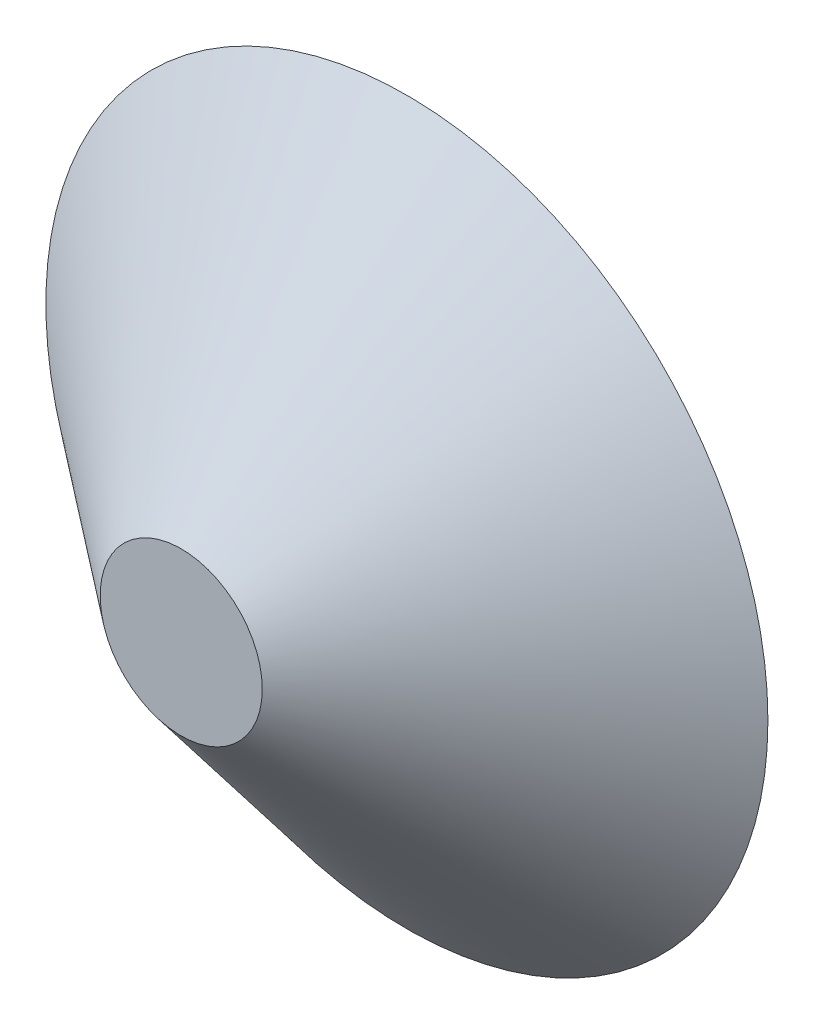
ISO-10303-21;
HEADER;
FILE_DESCRIPTION(('STEP AP214'),'2;1');
FILE_NAME('part.step','',(''),(''),'','','');
FILE_SCHEMA(('AUTOMOTIVE_DESIGN { 1 0 10303 214 1 1 1 1 }'));
ENDSEC;
DATA;
#1=APPLICATION_CONTEXT('core data for automotive mechanical design processes');
#2=APPLICATION_PROTOCOL_DEFINITION('international standard','automotive_design',2000,#1);
#3=PRODUCT_CONTEXT('',#1,'mechanical');
#4=PRODUCT('Part','Part','',(#3));
#5=PRODUCT_RELATED_PRODUCT_CATEGORY('part','',(#4));
#6=PRODUCT_DEFINITION_FORMATION('','',#4);
#7=PRODUCT_DEFINITION_CONTEXT('part definition',#1,'design');
#8=PRODUCT_DEFINITION('design','',#6,#7);
#9=PRODUCT_DEFINITION_SHAPE('','',#8);
#10=(LENGTH_UNIT() NAMED_UNIT(*) SI_UNIT(.MILLI.,.METRE.));
#11=(NAMED_UNIT(*) PLANE_ANGLE_UNIT() SI_UNIT($,.RADIAN.));
#12=(NAMED_UNIT(*) SI_UNIT($,.STERADIAN.) SOLID_ANGLE_UNIT());
#13=UNCERTAINTY_MEASURE_WITH_UNIT(LENGTH_MEASURE(1.E-05),#10,'distance_accuracy_value','');
#14=(GEOMETRIC_REPRESENTATION_CONTEXT(3) GLOBAL_UNCERTAINTY_ASSIGNED_CONTEXT((#13)) GLOBAL_UNIT_ASSIGNED_CONTEXT((#10,
#11,#12)) REPRESENTATION_CONTEXT('',''));
#15=CARTESIAN_POINT('',(0.,0.,0.));
#16=DIRECTION('',(0.,0.,1.));
#17=DIRECTION('',(1.,0.,0.));
#18=AXIS2_PLACEMENT_3D('',#15,#16,#17);
#19=CARTESIAN_POINT('',(0.,0.,0.));
#20=DIRECTION('',(0.,0.,-1.));
#21=DIRECTION('',(1.,0.,0.));
#22=AXIS2_PLACEMENT_3D('',#19,#20,#21);
#23=CONICAL_SURFACE('',#22,71.67,0.892386846544703);
#24=CARTESIAN_POINT('',(0.,0.,44.8));
#25=DIRECTION('',(0.,0.,1.));
#26=DIRECTION('',(1.,0.,0.));
#27=AXIS2_PLACEMENT_3D('',#24,#25,#26);
#28=CIRCLE('',#27,16.0892276056228);
#29=CARTESIAN_POINT('',(16.0892276056228,0.,44.8));
#30=VERTEX_POINT('',#29);
#31=EDGE_CURVE('E10',#30,#30,#28,.T.);
#32=ORIENTED_EDGE('',*,*,#31,.F.);
#33=EDGE_LOOP('',(#32));
#34=FACE_BOUND('',#33,.T.);
#35=CARTESIAN_POINT('',(0.,0.,0.));
#36=DIRECTION('',(0.,0.,1.));
#37=DIRECTION('',(1.,0.,0.));
#38=AXIS2_PLACEMENT_3D('',#35,#36,#37);
#39=CIRCLE('',#38,71.67);
#40=CARTESIAN_POINT('',(71.67,0.,0.));
#41=VERTEX_POINT('',#40);
#42=EDGE_CURVE('E39',#41,#41,#39,.T.);
#43=ORIENTED_EDGE('',*,*,#42,.T.);
#44=EDGE_LOOP('',(#43));
#45=FACE_BOUND('',#44,.T.);
#46=ADVANCED_FACE('F33',(#34,#45),#23,.T.);
#47=CARTESIAN_POINT('',(0.,0.,44.8));
#48=DIRECTION('',(0.,0.,1.));
#49=DIRECTION('',(1.,0.,0.));
#50=AXIS2_PLACEMENT_3D('',#47,#48,#49);
#51=PLANE('',#50);
#52=ORIENTED_EDGE('',*,*,#31,.T.);
#53=EDGE_LOOP('',(#52));
#54=FACE_BOUND('',#53,.T.);
#55=ADVANCED_FACE('F48',(#54),#51,.T.);
#56=CARTESIAN_POINT('',(0.,0.,0.));
#57=DIRECTION('',(0.,0.,1.));
#58=DIRECTION('',(1.,0.,0.));
#59=AXIS2_PLACEMENT_3D('',#56,#57,#58);
#60=PLANE('',#59);
#61=ORIENTED_EDGE('',*,*,#42,.F.);
#62=EDGE_LOOP('',(#61));
#63=FACE_BOUND('',#62,.T.);
#64=ADVANCED_FACE('F46',(#63),#60,.F.);
#65=CLOSED_SHELL('',(#46,#55,#64));
#66=MANIFOLD_SOLID_BREP('B2',#65);
#67=ADVANCED_BREP_SHAPE_REPRESENTATION('',(#18,#66),#14);
#68=SHAPE_DEFINITION_REPRESENTATION(#9,#67);
ENDSEC;
END-ISO-10303-21;
